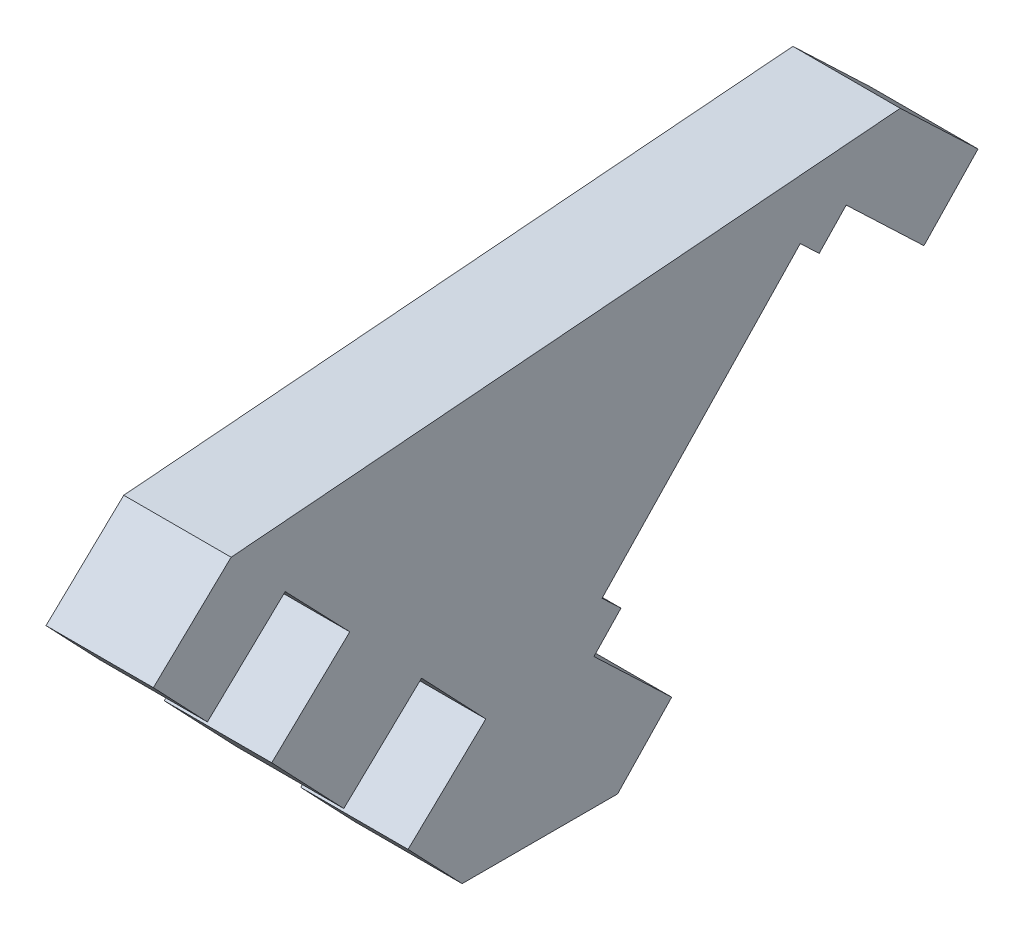
ISO-10303-21;
HEADER;
FILE_DESCRIPTION(('STEP AP214'),'2;1');
FILE_NAME('part.step','',(''),(''),'','','');
FILE_SCHEMA(('AUTOMOTIVE_DESIGN { 1 0 10303 214 1 1 1 1 }'));
ENDSEC;
DATA;
#1=APPLICATION_CONTEXT('core data for automotive mechanical design processes');
#2=APPLICATION_PROTOCOL_DEFINITION('international standard','automotive_design',2000,#1);
#3=PRODUCT_CONTEXT('',#1,'mechanical');
#4=PRODUCT('Part','Part','',(#3));
#5=PRODUCT_RELATED_PRODUCT_CATEGORY('part','',(#4));
#6=PRODUCT_DEFINITION_FORMATION('','',#4);
#7=PRODUCT_DEFINITION_CONTEXT('part definition',#1,'design');
#8=PRODUCT_DEFINITION('design','',#6,#7);
#9=PRODUCT_DEFINITION_SHAPE('','',#8);
#10=(LENGTH_UNIT() NAMED_UNIT(*) SI_UNIT(.MILLI.,.METRE.));
#11=(NAMED_UNIT(*) PLANE_ANGLE_UNIT() SI_UNIT($,.RADIAN.));
#12=(NAMED_UNIT(*) SI_UNIT($,.STERADIAN.) SOLID_ANGLE_UNIT());
#13=UNCERTAINTY_MEASURE_WITH_UNIT(LENGTH_MEASURE(1.E-05),#10,'distance_accuracy_value','');
#14=(GEOMETRIC_REPRESENTATION_CONTEXT(3) GLOBAL_UNCERTAINTY_ASSIGNED_CONTEXT((#13)) GLOBAL_UNIT_ASSIGNED_CONTEXT((#10,
#11,#12)) REPRESENTATION_CONTEXT('',''));
#15=CARTESIAN_POINT('',(0.,0.,0.));
#16=DIRECTION('',(0.,0.,1.));
#17=DIRECTION('',(1.,0.,0.));
#18=AXIS2_PLACEMENT_3D('',#15,#16,#17);
#19=CARTESIAN_POINT('',(108.5,-6.40997256157692,-7.94858198649549));
#20=DIRECTION('',(0.,0.689700373188125,-0.724094879987534));
#21=DIRECTION('',(0.,0.724094879987534,0.689700373188125));
#22=AXIS2_PLACEMENT_3D('',#19,#20,#21);
#23=PLANE('',#22);
#24=DIRECTION('',(0.,0.724094879987534,0.689700373188125));
#25=VECTOR('',#24,1.);
#26=CARTESIAN_POINT('',(112.61,-6.40997256157692,-7.94858198649549));
#27=LINE('',#26,#25);
#28=CARTESIAN_POINT('',(112.61,-6.40997256157692,-7.94858198649549));
#29=VERTEX_POINT('',#28);
#30=CARTESIAN_POINT('',(112.61,-4.23768792161431,-5.8794808669311));
#31=VERTEX_POINT('',#30);
#32=EDGE_CURVE('E204',#29,#31,#27,.T.);
#33=ORIENTED_EDGE('',*,*,#32,.T.);
#34=DIRECTION('',(1.,0.,0.));
#35=VECTOR('',#34,1.);
#36=CARTESIAN_POINT('',(108.5,-4.23768792161431,-5.8794808669311));
#37=LINE('',#36,#35);
#38=CARTESIAN_POINT('',(108.5,-4.23768792161431,-5.8794808669311));
#39=VERTEX_POINT('',#38);
#40=EDGE_CURVE('E11',#39,#31,#37,.T.);
#41=ORIENTED_EDGE('',*,*,#40,.F.);
#42=DIRECTION('',(0.,0.724094879987534,0.689700373188125));
#43=VECTOR('',#42,1.);
#44=CARTESIAN_POINT('',(108.5,-6.40997256157692,-7.94858198649549));
#45=LINE('',#44,#43);
#46=CARTESIAN_POINT('',(108.5,-6.40997256157692,-7.94858198649549));
#47=VERTEX_POINT('',#46);
#48=EDGE_CURVE('E249',#47,#39,#45,.T.);
#49=ORIENTED_EDGE('',*,*,#48,.F.);
#50=DIRECTION('',(1.,0.,0.));
#51=VECTOR('',#50,1.);
#52=CARTESIAN_POINT('',(108.5,-6.40997256157692,-7.94858198649549));
#53=LINE('',#52,#51);
#54=EDGE_CURVE('E56',#47,#29,#53,.T.);
#55=ORIENTED_EDGE('',*,*,#54,.T.);
#56=EDGE_LOOP('',(#33,#41,#49,#55));
#57=FACE_BOUND('',#56,.T.);
#58=ADVANCED_FACE('F33',(#57),#23,.F.);
#59=CARTESIAN_POINT('',(108.5,-4.23768792161431,-5.8794808669311));
#60=DIRECTION('',(0.,-0.724094879987533,-0.689700373188126));
#61=DIRECTION('',(0.,0.689700373188126,-0.724094879987533));
#62=AXIS2_PLACEMENT_3D('',#59,#60,#61);
#63=PLANE('',#62);
#64=DIRECTION('',(0.,0.689700373188126,-0.724094879987533));
#65=VECTOR('',#64,1.);
#66=CARTESIAN_POINT('',(112.61,-4.23768792161431,-5.8794808669311));
#67=LINE('',#66,#65);
#68=CARTESIAN_POINT('',(112.61,-1.40301938781112,-8.85551082367985));
#69=VERTEX_POINT('',#68);
#70=EDGE_CURVE('E206',#31,#69,#67,.T.);
#71=ORIENTED_EDGE('',*,*,#70,.T.);
#72=DIRECTION('',(1.,0.,0.));
#73=VECTOR('',#72,1.);
#74=CARTESIAN_POINT('',(108.5,-1.40301938781112,-8.85551082367985));
#75=LINE('',#74,#73);
#76=CARTESIAN_POINT('',(108.5,-1.40301938781112,-8.85551082367985));
#77=VERTEX_POINT('',#76);
#78=EDGE_CURVE('E40',#77,#69,#75,.T.);
#79=ORIENTED_EDGE('',*,*,#78,.F.);
#80=DIRECTION('',(0.,0.689700373188126,-0.724094879987533));
#81=VECTOR('',#80,1.);
#82=CARTESIAN_POINT('',(108.5,-4.23768792161431,-5.8794808669311));
#83=LINE('',#82,#81);
#84=EDGE_CURVE('E125',#39,#77,#83,.T.);
#85=ORIENTED_EDGE('',*,*,#84,.F.);
#86=ORIENTED_EDGE('',*,*,#40,.T.);
#87=EDGE_LOOP('',(#71,#79,#85,#86));
#88=FACE_BOUND('',#87,.T.);
#89=ADVANCED_FACE('F356',(#88),#63,.F.);
#90=CARTESIAN_POINT('',(108.5,-1.40301938781112,-8.85551082367985));
#91=DIRECTION('',(0.,-0.996735550535678,-0.0807356321480145));
#92=DIRECTION('',(0.,0.0807356321480145,-0.996735550535678));
#93=AXIS2_PLACEMENT_3D('',#90,#91,#92);
#94=PLANE('',#93);
#95=DIRECTION('',(0.,0.0807356321480145,-0.996735550535678));
#96=VECTOR('',#95,1.);
#97=CARTESIAN_POINT('',(112.61,-1.40301938781112,-8.85551082367985));
#98=LINE('',#97,#96);
#99=CARTESIAN_POINT('',(112.61,0.671552745258446,-34.4674957944561));
#100=VERTEX_POINT('',#99);
#101=EDGE_CURVE('E209',#69,#100,#98,.T.);
#102=ORIENTED_EDGE('',*,*,#101,.T.);
#103=DIRECTION('',(1.,0.,0.));
#104=VECTOR('',#103,1.);
#105=CARTESIAN_POINT('',(108.5,0.671552745258446,-34.4674957944561));
#106=LINE('',#105,#104);
#107=CARTESIAN_POINT('',(108.5,0.671552745258446,-34.4674957944561));
#108=VERTEX_POINT('',#107);
#109=EDGE_CURVE('E281',#108,#100,#106,.T.);
#110=ORIENTED_EDGE('',*,*,#109,.F.);
#111=DIRECTION('',(0.,0.0807356321480145,-0.996735550535678));
#112=VECTOR('',#111,1.);
#113=CARTESIAN_POINT('',(108.5,-1.40301938781112,-8.85551082367985));
#114=LINE('',#113,#112);
#115=EDGE_CURVE('E289',#77,#108,#114,.T.);
#116=ORIENTED_EDGE('',*,*,#115,.F.);
#117=ORIENTED_EDGE('',*,*,#78,.T.);
#118=EDGE_LOOP('',(#102,#110,#116,#117));
#119=FACE_BOUND('',#118,.T.);
#120=ADVANCED_FACE('F287',(#119),#94,.F.);
#121=CARTESIAN_POINT('',(108.5,0.671552745258446,-34.4674957944561));
#122=DIRECTION('',(0.,-0.724094879987533,0.689700373188126));
#123=DIRECTION('',(0.,-0.689700373188126,-0.724094879987533));
#124=AXIS2_PLACEMENT_3D('',#121,#122,#123);
#125=PLANE('',#124);
#126=DIRECTION('',(0.,-0.689700373188126,-0.724094879987533));
#127=VECTOR('',#126,1.);
#128=CARTESIAN_POINT('',(112.61,0.671552745258446,-34.4674957944561));
#129=LINE('',#128,#127);
#130=CARTESIAN_POINT('',(112.61,-2.16311578854475,-37.4435257512049));
#131=VERTEX_POINT('',#130);
#132=EDGE_CURVE('E211',#100,#131,#129,.T.);
#133=ORIENTED_EDGE('',*,*,#132,.T.);
#134=DIRECTION('',(1.,0.,0.));
#135=VECTOR('',#134,1.);
#136=CARTESIAN_POINT('',(108.5,-2.16311578854475,-37.4435257512049));
#137=LINE('',#136,#135);
#138=CARTESIAN_POINT('',(108.5,-2.16311578854475,-37.4435257512049));
#139=VERTEX_POINT('',#138);
#140=EDGE_CURVE('E278',#139,#131,#137,.T.);
#141=ORIENTED_EDGE('',*,*,#140,.F.);
#142=DIRECTION('',(0.,-0.689700373188126,-0.724094879987533));
#143=VECTOR('',#142,1.);
#144=CARTESIAN_POINT('',(108.5,0.671552745258446,-34.4674957944561));
#145=LINE('',#144,#143);
#146=EDGE_CURVE('E307',#108,#139,#145,.T.);
#147=ORIENTED_EDGE('',*,*,#146,.F.);
#148=ORIENTED_EDGE('',*,*,#109,.T.);
#149=EDGE_LOOP('',(#133,#141,#147,#148));
#150=FACE_BOUND('',#149,.T.);
#151=ADVANCED_FACE('F297',(#150),#125,.F.);
#152=CARTESIAN_POINT('',(108.5,-2.16311578854475,-37.4435257512049));
#153=DIRECTION('',(0.,0.689700373188127,0.724094879987532));
#154=DIRECTION('',(0.,-0.724094879987532,0.689700373188127));
#155=AXIS2_PLACEMENT_3D('',#152,#153,#154);
#156=PLANE('',#155);
#157=DIRECTION('',(0.,-0.724094879987532,0.689700373188127));
#158=VECTOR('',#157,1.);
#159=CARTESIAN_POINT('',(112.61,-2.16311578854475,-37.4435257512049));
#160=LINE('',#159,#158);
#161=CARTESIAN_POINT('',(112.61,-4.33540042850735,-35.3744246316405));
#162=VERTEX_POINT('',#161);
#163=EDGE_CURVE('E213',#131,#162,#160,.T.);
#164=ORIENTED_EDGE('',*,*,#163,.T.);
#165=DIRECTION('',(1.,0.,0.));
#166=VECTOR('',#165,1.);
#167=CARTESIAN_POINT('',(108.5,-4.33540042850735,-35.3744246316405));
#168=LINE('',#167,#166);
#169=CARTESIAN_POINT('',(108.5,-4.33540042850735,-35.3744246316405));
#170=VERTEX_POINT('',#169);
#171=EDGE_CURVE('E275',#170,#162,#168,.T.);
#172=ORIENTED_EDGE('',*,*,#171,.F.);
#173=DIRECTION('',(0.,-0.724094879987532,0.689700373188127));
#174=VECTOR('',#173,1.);
#175=CARTESIAN_POINT('',(108.5,-2.16311578854475,-37.4435257512049));
#176=LINE('',#175,#174);
#177=EDGE_CURVE('E303',#139,#170,#176,.T.);
#178=ORIENTED_EDGE('',*,*,#177,.F.);
#179=ORIENTED_EDGE('',*,*,#140,.T.);
#180=EDGE_LOOP('',(#164,#172,#178,#179));
#181=FACE_BOUND('',#180,.T.);
#182=ADVANCED_FACE('F301',(#181),#156,.F.);
#183=CARTESIAN_POINT('',(108.5,-4.33540042850735,-35.3744246316405));
#184=DIRECTION('',(0.,0.724094879987532,-0.689700373188127));
#185=DIRECTION('',(0.,0.689700373188127,0.724094879987532));
#186=AXIS2_PLACEMENT_3D('',#183,#184,#185);
#187=PLANE('',#186);
#188=DIRECTION('',(0.,0.689700373188127,0.724094879987532));
#189=VECTOR('',#188,1.);
#190=CARTESIAN_POINT('',(112.61,-4.33540042850735,-35.3744246316405));
#191=LINE('',#190,#189);
#192=CARTESIAN_POINT('',(112.61,-1.50073189470416,-32.3983946748917));
#193=VERTEX_POINT('',#192);
#194=EDGE_CURVE('E215',#162,#193,#191,.T.);
#195=ORIENTED_EDGE('',*,*,#194,.T.);
#196=DIRECTION('',(1.,0.,0.));
#197=VECTOR('',#196,1.);
#198=CARTESIAN_POINT('',(108.5,-1.50073189470416,-32.3983946748917));
#199=LINE('',#198,#197);
#200=CARTESIAN_POINT('',(108.5,-1.50073189470416,-32.3983946748917));
#201=VERTEX_POINT('',#200);
#202=EDGE_CURVE('E272',#201,#193,#199,.T.);
#203=ORIENTED_EDGE('',*,*,#202,.F.);
#204=DIRECTION('',(0.,0.689700373188127,0.724094879987532));
#205=VECTOR('',#204,1.);
#206=CARTESIAN_POINT('',(108.5,-4.33540042850735,-35.3744246316405));
#207=LINE('',#206,#205);
#208=EDGE_CURVE('E306',#170,#201,#207,.T.);
#209=ORIENTED_EDGE('',*,*,#208,.F.);
#210=ORIENTED_EDGE('',*,*,#171,.T.);
#211=EDGE_LOOP('',(#195,#203,#209,#210));
#212=FACE_BOUND('',#211,.T.);
#213=ADVANCED_FACE('F429',(#212),#187,.F.);
#214=CARTESIAN_POINT('',(108.5,-5.15206178771529,-28.9205029517986));
#215=DIRECTION('',(0.,-0.689700373188125,-0.724094879987534));
#216=DIRECTION('',(0.,0.724094879987534,-0.689700373188125));
#217=AXIS2_PLACEMENT_3D('',#214,#215,#216);
#218=PLANE('',#217);
#219=DIRECTION('',(-1.,0.,0.));
#220=VECTOR('',#219,1.);
#221=CARTESIAN_POINT('',(108.499,-2.58687421468546,-31.3638441151095));
#222=LINE('',#221,#220);
#223=CARTESIAN_POINT('',(112.61,-2.58687421468546,-31.3638441151095));
#224=VERTEX_POINT('',#223);
#225=CARTESIAN_POINT('',(108.5,-2.58687421468546,-31.3638441151095));
#226=VERTEX_POINT('',#225);
#227=EDGE_CURVE('E47',#224,#226,#222,.T.);
#228=ORIENTED_EDGE('',*,*,#227,.T.);
#229=DIRECTION('',(0.,0.724094879987534,-0.689700373188125));
#230=VECTOR('',#229,1.);
#231=CARTESIAN_POINT('',(108.5,-5.15206178771529,-28.9205029517986));
#232=LINE('',#231,#230);
#233=EDGE_CURVE('E309',#226,#201,#232,.T.);
#234=ORIENTED_EDGE('',*,*,#233,.T.);
#235=ORIENTED_EDGE('',*,*,#202,.T.);
#236=DIRECTION('',(0.,0.724094879987534,-0.689700373188125));
#237=VECTOR('',#236,1.);
#238=CARTESIAN_POINT('',(112.61,-5.15206178771529,-28.9205029517986));
#239=LINE('',#238,#237);
#240=EDGE_CURVE('E218',#224,#193,#239,.T.);
#241=ORIENTED_EDGE('',*,*,#240,.F.);
#242=EDGE_LOOP('',(#228,#234,#235,#241));
#243=FACE_BOUND('',#242,.T.);
#244=ADVANCED_FACE('F425',(#243),#218,.T.);
#245=CARTESIAN_POINT('',(108.5,-11.6380602145296,-22.742589450258));
#246=DIRECTION('',(0.,-0.689700373188126,-0.724094879987533));
#247=DIRECTION('',(0.,0.724094879987533,-0.689700373188126));
#248=AXIS2_PLACEMENT_3D('',#245,#246,#247);
#249=PLANE('',#248);
#250=DIRECTION('',(1.,0.,0.));
#251=VECTOR('',#250,1.);
#252=CARTESIAN_POINT('',(108.499,-10.5519178945483,-23.7771400100402));
#253=LINE('',#252,#251);
#254=CARTESIAN_POINT('',(108.5,-10.5519178945483,-23.7771400100402));
#255=VERTEX_POINT('',#254);
#256=CARTESIAN_POINT('',(112.61,-10.5519178945483,-23.7771400100402));
#257=VERTEX_POINT('',#256);
#258=EDGE_CURVE('E387',#255,#257,#253,.T.);
#259=ORIENTED_EDGE('',*,*,#258,.T.);
#260=DIRECTION('',(0.,0.724094879987533,-0.689700373188126));
#261=VECTOR('',#260,1.);
#262=CARTESIAN_POINT('',(112.61,-11.6380602145296,-22.742589450258));
#263=LINE('',#262,#261);
#264=CARTESIAN_POINT('',(112.61,-11.6380602145296,-22.742589450258));
#265=VERTEX_POINT('',#264);
#266=EDGE_CURVE('E220',#265,#257,#263,.T.);
#267=ORIENTED_EDGE('',*,*,#266,.F.);
#268=DIRECTION('',(1.,0.,0.));
#269=VECTOR('',#268,1.);
#270=CARTESIAN_POINT('',(108.5,-11.6380602145296,-22.742589450258));
#271=LINE('',#270,#269);
#272=CARTESIAN_POINT('',(108.5,-11.6380602145296,-22.742589450258));
#273=VERTEX_POINT('',#272);
#274=EDGE_CURVE('E270',#273,#265,#271,.T.);
#275=ORIENTED_EDGE('',*,*,#274,.F.);
#276=DIRECTION('',(0.,0.724094879987533,-0.689700373188126));
#277=VECTOR('',#276,1.);
#278=CARTESIAN_POINT('',(108.5,-11.6380602145296,-22.742589450258));
#279=LINE('',#278,#277);
#280=EDGE_CURVE('E315',#273,#255,#279,.T.);
#281=ORIENTED_EDGE('',*,*,#280,.T.);
#282=EDGE_LOOP('',(#259,#267,#275,#281));
#283=FACE_BOUND('',#282,.T.);
#284=ADVANCED_FACE('F393',(#283),#249,.T.);
#285=CARTESIAN_POINT('',(108.5,-14.4727287483328,-25.7186194070067));
#286=DIRECTION('',(0.,0.724094879987533,-0.689700373188126));
#287=DIRECTION('',(0.,0.689700373188126,0.724094879987533));
#288=AXIS2_PLACEMENT_3D('',#285,#286,#287);
#289=PLANE('',#288);
#290=DIRECTION('',(0.,0.689700373188126,0.724094879987533));
#291=VECTOR('',#290,1.);
#292=CARTESIAN_POINT('',(112.61,-14.4727287483328,-25.7186194070067));
#293=LINE('',#292,#291);
#294=CARTESIAN_POINT('',(112.61,-14.4727287483328,-25.7186194070067));
#295=VERTEX_POINT('',#294);
#296=EDGE_CURVE('E223',#295,#265,#293,.T.);
#297=ORIENTED_EDGE('',*,*,#296,.F.);
#298=DIRECTION('',(1.,0.,0.));
#299=VECTOR('',#298,1.);
#300=CARTESIAN_POINT('',(108.5,-14.4727287483328,-25.7186194070067));
#301=LINE('',#300,#299);
#302=CARTESIAN_POINT('',(108.5,-14.4727287483328,-25.7186194070067));
#303=VERTEX_POINT('',#302);
#304=EDGE_CURVE('E268',#303,#295,#301,.T.);
#305=ORIENTED_EDGE('',*,*,#304,.F.);
#306=DIRECTION('',(0.,0.689700373188126,0.724094879987533));
#307=VECTOR('',#306,1.);
#308=CARTESIAN_POINT('',(108.5,-14.4727287483328,-25.7186194070067));
#309=LINE('',#308,#307);
#310=EDGE_CURVE('E318',#303,#273,#309,.T.);
#311=ORIENTED_EDGE('',*,*,#310,.T.);
#312=ORIENTED_EDGE('',*,*,#274,.T.);
#313=EDGE_LOOP('',(#297,#305,#311,#312));
#314=FACE_BOUND('',#313,.T.);
#315=ADVANCED_FACE('F406',(#314),#289,.T.);
#316=CARTESIAN_POINT('',(108.5,-14.4727287483328,-25.7186194070067));
#317=DIRECTION('',(0.,0.689700373188118,0.724094879987541));
#318=DIRECTION('',(0.,-0.724094879987541,0.689700373188118));
#319=AXIS2_PLACEMENT_3D('',#316,#317,#318);
#320=PLANE('',#319);
#321=DIRECTION('',(0.,-0.724094879987541,0.689700373188118));
#322=VECTOR('',#321,1.);
#323=CARTESIAN_POINT('',(112.61,-14.4727287483328,-25.7186194070067));
#324=LINE('',#323,#322);
#325=CARTESIAN_POINT('',(112.61,-16.6450133882954,-23.6495182874424));
#326=VERTEX_POINT('',#325);
#327=EDGE_CURVE('E226',#295,#326,#324,.T.);
#328=ORIENTED_EDGE('',*,*,#327,.T.);
#329=DIRECTION('',(1.,0.,0.));
#330=VECTOR('',#329,1.);
#331=CARTESIAN_POINT('',(108.5,-16.6450133882954,-23.6495182874424));
#332=LINE('',#331,#330);
#333=CARTESIAN_POINT('',(108.5,-16.6450133882954,-23.6495182874424));
#334=VERTEX_POINT('',#333);
#335=EDGE_CURVE('E265',#334,#326,#332,.T.);
#336=ORIENTED_EDGE('',*,*,#335,.F.);
#337=DIRECTION('',(0.,-0.724094879987541,0.689700373188118));
#338=VECTOR('',#337,1.);
#339=CARTESIAN_POINT('',(108.5,-14.4727287483328,-25.7186194070067));
#340=LINE('',#339,#338);
#341=EDGE_CURVE('E321',#303,#334,#340,.T.);
#342=ORIENTED_EDGE('',*,*,#341,.F.);
#343=ORIENTED_EDGE('',*,*,#304,.T.);
#344=EDGE_LOOP('',(#328,#336,#342,#343));
#345=FACE_BOUND('',#344,.T.);
#346=ADVANCED_FACE('F469',(#345),#320,.F.);
#347=CARTESIAN_POINT('',(108.5,-16.6450133882954,-23.6495182874424));
#348=DIRECTION('',(0.,1.,0.));
#349=DIRECTION('',(0.,0.,1.));
#350=AXIS2_PLACEMENT_3D('',#347,#348,#349);
#351=PLANE('',#350);
#352=DIRECTION('',(0.,0.,1.));
#353=VECTOR('',#352,1.);
#354=CARTESIAN_POINT('',(112.61,-16.6450133882954,-23.6495182874424));
#355=LINE('',#354,#353);
#356=CARTESIAN_POINT('',(112.61,-16.6450133882954,-17.6974583739448));
#357=VERTEX_POINT('',#356);
#358=EDGE_CURVE('E228',#326,#357,#355,.T.);
#359=ORIENTED_EDGE('',*,*,#358,.T.);
#360=DIRECTION('',(1.,0.,0.));
#361=VECTOR('',#360,1.);
#362=CARTESIAN_POINT('',(108.5,-16.6450133882954,-17.6974583739448));
#363=LINE('',#362,#361);
#364=CARTESIAN_POINT('',(108.5,-16.6450133882954,-17.6974583739448));
#365=VERTEX_POINT('',#364);
#366=EDGE_CURVE('E262',#365,#357,#363,.T.);
#367=ORIENTED_EDGE('',*,*,#366,.F.);
#368=DIRECTION('',(0.,0.,1.));
#369=VECTOR('',#368,1.);
#370=CARTESIAN_POINT('',(108.5,-16.6450133882954,-23.6495182874424));
#371=LINE('',#370,#369);
#372=EDGE_CURVE('E323',#334,#365,#371,.T.);
#373=ORIENTED_EDGE('',*,*,#372,.F.);
#374=ORIENTED_EDGE('',*,*,#335,.T.);
#375=EDGE_LOOP('',(#359,#367,#373,#374));
#376=FACE_BOUND('',#375,.T.);
#377=ADVANCED_FACE('F480',(#376),#351,.F.);
#378=CARTESIAN_POINT('',(108.5,-16.6450133882954,-17.6974583739448));
#379=DIRECTION('',(0.,0.689700373188125,-0.724094879987534));
#380=DIRECTION('',(0.,0.724094879987534,0.689700373188125));
#381=AXIS2_PLACEMENT_3D('',#378,#379,#380);
#382=PLANE('',#381);
#383=DIRECTION('',(0.,0.724094879987534,0.689700373188125));
#384=VECTOR('',#383,1.);
#385=CARTESIAN_POINT('',(112.61,-16.6450133882954,-17.6974583739448));
#386=LINE('',#385,#384);
#387=CARTESIAN_POINT('',(112.61,-14.4727287483328,-15.6283572543805));
#388=VERTEX_POINT('',#387);
#389=EDGE_CURVE('E230',#357,#388,#386,.T.);
#390=ORIENTED_EDGE('',*,*,#389,.T.);
#391=DIRECTION('',(1.,0.,0.));
#392=VECTOR('',#391,1.);
#393=CARTESIAN_POINT('',(108.5,-14.4727287483328,-15.6283572543805));
#394=LINE('',#393,#392);
#395=CARTESIAN_POINT('',(108.5,-14.4727287483328,-15.6283572543805));
#396=VERTEX_POINT('',#395);
#397=EDGE_CURVE('E259',#396,#388,#394,.T.);
#398=ORIENTED_EDGE('',*,*,#397,.F.);
#399=DIRECTION('',(0.,0.724094879987534,0.689700373188125));
#400=VECTOR('',#399,1.);
#401=CARTESIAN_POINT('',(108.5,-16.6450133882954,-17.6974583739448));
#402=LINE('',#401,#400);
#403=EDGE_CURVE('E325',#365,#396,#402,.T.);
#404=ORIENTED_EDGE('',*,*,#403,.F.);
#405=ORIENTED_EDGE('',*,*,#366,.T.);
#406=EDGE_LOOP('',(#390,#398,#404,#405));
#407=FACE_BOUND('',#406,.T.);
#408=ADVANCED_FACE('F490',(#407),#382,.F.);
#409=CARTESIAN_POINT('',(108.5,-14.4727287483328,-15.6283572543805));
#410=DIRECTION('',(0.,-0.724094879987534,-0.689700373188125));
#411=DIRECTION('',(0.,0.689700373188125,-0.724094879987534));
#412=AXIS2_PLACEMENT_3D('',#409,#410,#411);
#413=PLANE('',#412);
#414=DIRECTION('',(0.,0.689700373188125,-0.724094879987534));
#415=VECTOR('',#414,1.);
#416=CARTESIAN_POINT('',(112.61,-14.4727287483328,-15.6283572543805));
#417=LINE('',#416,#415);
#418=CARTESIAN_POINT('',(112.61,-11.6380602145296,-18.6043872111292));
#419=VERTEX_POINT('',#418);
#420=EDGE_CURVE('E232',#388,#419,#417,.T.);
#421=ORIENTED_EDGE('',*,*,#420,.T.);
#422=DIRECTION('',(1.,0.,0.));
#423=VECTOR('',#422,1.);
#424=CARTESIAN_POINT('',(108.5,-11.6380602145296,-18.6043872111292));
#425=LINE('',#424,#423);
#426=CARTESIAN_POINT('',(108.5,-11.6380602145296,-18.6043872111292));
#427=VERTEX_POINT('',#426);
#428=EDGE_CURVE('E257',#427,#419,#425,.T.);
#429=ORIENTED_EDGE('',*,*,#428,.F.);
#430=DIRECTION('',(0.,0.689700373188125,-0.724094879987534));
#431=VECTOR('',#430,1.);
#432=CARTESIAN_POINT('',(108.5,-14.4727287483328,-15.6283572543805));
#433=LINE('',#432,#431);
#434=EDGE_CURVE('E327',#396,#427,#433,.T.);
#435=ORIENTED_EDGE('',*,*,#434,.F.);
#436=ORIENTED_EDGE('',*,*,#397,.T.);
#437=EDGE_LOOP('',(#421,#429,#435,#436));
#438=FACE_BOUND('',#437,.T.);
#439=ADVANCED_FACE('F500',(#438),#413,.F.);
#440=CARTESIAN_POINT('',(108.5,-9.05487188112677,-16.143900323563));
#441=DIRECTION('',(0.,-0.689700373188125,0.724094879987534));
#442=DIRECTION('',(0.,-0.724094879987534,-0.689700373188125));
#443=AXIS2_PLACEMENT_3D('',#440,#441,#442);
#444=PLANE('',#443);
#445=DIRECTION('',(0.,-0.724094879987534,-0.689700373188125));
#446=VECTOR('',#445,1.);
#447=CARTESIAN_POINT('',(112.61,-9.05487188112677,-16.143900323563));
#448=LINE('',#447,#446);
#449=CARTESIAN_POINT('',(112.61,-9.05487188112677,-16.143900323563));
#450=VERTEX_POINT('',#449);
#451=EDGE_CURVE('E235',#450,#419,#448,.T.);
#452=ORIENTED_EDGE('',*,*,#451,.F.);
#453=DIRECTION('',(1.,0.,0.));
#454=VECTOR('',#453,1.);
#455=CARTESIAN_POINT('',(108.5,-9.05487188112677,-16.143900323563));
#456=LINE('',#455,#454);
#457=CARTESIAN_POINT('',(108.5,-9.05487188112677,-16.143900323563));
#458=VERTEX_POINT('',#457);
#459=EDGE_CURVE('E255',#458,#450,#456,.T.);
#460=ORIENTED_EDGE('',*,*,#459,.F.);
#461=DIRECTION('',(0.,-0.724094879987534,-0.689700373188125));
#462=VECTOR('',#461,1.);
#463=CARTESIAN_POINT('',(108.5,-9.05487188112677,-16.143900323563));
#464=LINE('',#463,#462);
#465=EDGE_CURVE('E329',#458,#427,#464,.T.);
#466=ORIENTED_EDGE('',*,*,#465,.T.);
#467=ORIENTED_EDGE('',*,*,#428,.T.);
#468=EDGE_LOOP('',(#452,#460,#466,#467));
#469=FACE_BOUND('',#468,.T.);
#470=ADVANCED_FACE('F342',(#469),#444,.T.);
#471=CARTESIAN_POINT('',(108.5,-11.88954041493,-13.1678703668143));
#472=DIRECTION('',(0.,-0.724094879987534,-0.689700373188125));
#473=DIRECTION('',(0.,0.689700373188125,-0.724094879987534));
#474=AXIS2_PLACEMENT_3D('',#471,#472,#473);
#475=PLANE('',#474);
#476=DIRECTION('',(0.,0.689700373188125,-0.724094879987534));
#477=VECTOR('',#476,1.);
#478=CARTESIAN_POINT('',(112.61,-11.88954041493,-13.1678703668143));
#479=LINE('',#478,#477);
#480=CARTESIAN_POINT('',(112.61,-11.88954041493,-13.1678703668143));
#481=VERTEX_POINT('',#480);
#482=EDGE_CURVE('E238',#481,#450,#479,.T.);
#483=ORIENTED_EDGE('',*,*,#482,.F.);
#484=DIRECTION('',(1.,0.,0.));
#485=VECTOR('',#484,1.);
#486=CARTESIAN_POINT('',(108.5,-11.88954041493,-13.1678703668143));
#487=LINE('',#486,#485);
#488=CARTESIAN_POINT('',(108.5,-11.88954041493,-13.1678703668143));
#489=VERTEX_POINT('',#488);
#490=EDGE_CURVE('E253',#489,#481,#487,.T.);
#491=ORIENTED_EDGE('',*,*,#490,.F.);
#492=DIRECTION('',(0.,0.689700373188125,-0.724094879987534));
#493=VECTOR('',#492,1.);
#494=CARTESIAN_POINT('',(108.5,-11.88954041493,-13.1678703668143));
#495=LINE('',#494,#493);
#496=EDGE_CURVE('E332',#489,#458,#495,.T.);
#497=ORIENTED_EDGE('',*,*,#496,.T.);
#498=ORIENTED_EDGE('',*,*,#459,.T.);
#499=EDGE_LOOP('',(#483,#491,#497,#498));
#500=FACE_BOUND('',#499,.T.);
#501=ADVANCED_FACE('F336',(#500),#475,.T.);
#502=CARTESIAN_POINT('',(108.5,-11.88954041493,-13.1678703668143));
#503=DIRECTION('',(0.,0.689700373188125,-0.724094879987534));
#504=DIRECTION('',(0.,0.724094879987534,0.689700373188125));
#505=AXIS2_PLACEMENT_3D('',#502,#503,#504);
#506=PLANE('',#505);
#507=DIRECTION('',(0.,0.724094879987534,0.689700373188125));
#508=VECTOR('',#507,1.);
#509=CARTESIAN_POINT('',(112.61,-11.88954041493,-13.1678703668143));
#510=LINE('',#509,#508);
#511=CARTESIAN_POINT('',(112.61,-8.99316089497979,-10.4090688740617));
#512=VERTEX_POINT('',#511);
#513=EDGE_CURVE('E241',#481,#512,#510,.T.);
#514=ORIENTED_EDGE('',*,*,#513,.T.);
#515=DIRECTION('',(1.,0.,0.));
#516=VECTOR('',#515,1.);
#517=CARTESIAN_POINT('',(108.5,-8.99316089497979,-10.4090688740617));
#518=LINE('',#517,#516);
#519=CARTESIAN_POINT('',(108.5,-8.99316089497979,-10.4090688740617));
#520=VERTEX_POINT('',#519);
#521=EDGE_CURVE('E195',#520,#512,#518,.T.);
#522=ORIENTED_EDGE('',*,*,#521,.F.);
#523=DIRECTION('',(0.,0.724094879987534,0.689700373188125));
#524=VECTOR('',#523,1.);
#525=CARTESIAN_POINT('',(108.5,-11.88954041493,-13.1678703668143));
#526=LINE('',#525,#524);
#527=EDGE_CURVE('E182',#489,#520,#526,.T.);
#528=ORIENTED_EDGE('',*,*,#527,.F.);
#529=ORIENTED_EDGE('',*,*,#490,.T.);
#530=EDGE_LOOP('',(#514,#522,#528,#529));
#531=FACE_BOUND('',#530,.T.);
#532=ADVANCED_FACE('F346',(#531),#506,.F.);
#533=CARTESIAN_POINT('',(108.5,-8.99316089497979,-10.4090688740617));
#534=DIRECTION('',(0.,-0.724094879987533,-0.689700373188126));
#535=DIRECTION('',(0.,0.689700373188126,-0.724094879987533));
#536=AXIS2_PLACEMENT_3D('',#533,#534,#535);
#537=PLANE('',#536);
#538=DIRECTION('',(0.,0.689700373188126,-0.724094879987533));
#539=VECTOR('',#538,1.);
#540=CARTESIAN_POINT('',(112.61,-8.99316089497979,-10.4090688740617));
#541=LINE('',#540,#539);
#542=CARTESIAN_POINT('',(112.61,-6.1468231766742,-13.397349943149));
#543=VERTEX_POINT('',#542);
#544=EDGE_CURVE('E191',#512,#543,#541,.T.);
#545=ORIENTED_EDGE('',*,*,#544,.T.);
#546=DIRECTION('',(1.,0.,0.));
#547=VECTOR('',#546,1.);
#548=CARTESIAN_POINT('',(108.5,-6.1468231766742,-13.397349943149));
#549=LINE('',#548,#547);
#550=CARTESIAN_POINT('',(108.5,-6.1468231766742,-13.397349943149));
#551=VERTEX_POINT('',#550);
#552=EDGE_CURVE('E188',#551,#543,#549,.T.);
#553=ORIENTED_EDGE('',*,*,#552,.F.);
#554=DIRECTION('',(0.,0.689700373188126,-0.724094879987533));
#555=VECTOR('',#554,1.);
#556=CARTESIAN_POINT('',(108.5,-8.99316089497979,-10.4090688740617));
#557=LINE('',#556,#555);
#558=EDGE_CURVE('E173',#520,#551,#557,.T.);
#559=ORIENTED_EDGE('',*,*,#558,.F.);
#560=ORIENTED_EDGE('',*,*,#521,.T.);
#561=EDGE_LOOP('',(#545,#553,#559,#560));
#562=FACE_BOUND('',#561,.T.);
#563=ADVANCED_FACE('F189',(#562),#537,.F.);
#564=CARTESIAN_POINT('',(108.5,-3.57530402777374,-10.9246119432442));
#565=DIRECTION('',(0.,-0.693126693876089,0.720815778293179));
#566=DIRECTION('',(0.,-0.720815778293179,-0.693126693876089));
#567=AXIS2_PLACEMENT_3D('',#564,#565,#566);
#568=PLANE('',#567);
#569=DIRECTION('',(0.,-0.720815778293179,-0.693126693876089));
#570=VECTOR('',#569,1.);
#571=CARTESIAN_POINT('',(112.61,-3.57530402777374,-10.9246119432442));
#572=LINE('',#571,#570);
#573=CARTESIAN_POINT('',(112.61,-3.57530402777374,-10.9246119432442));
#574=VERTEX_POINT('',#573);
#575=EDGE_CURVE('E244',#574,#543,#572,.T.);
#576=ORIENTED_EDGE('',*,*,#575,.F.);
#577=DIRECTION('',(1.,0.,0.));
#578=VECTOR('',#577,1.);
#579=CARTESIAN_POINT('',(108.5,-3.57530402777374,-10.9246119432442));
#580=LINE('',#579,#578);
#581=CARTESIAN_POINT('',(108.5,-3.57530402777374,-10.9246119432442));
#582=VERTEX_POINT('',#581);
#583=EDGE_CURVE('E196',#582,#574,#580,.T.);
#584=ORIENTED_EDGE('',*,*,#583,.F.);
#585=DIRECTION('',(0.,-0.720815778293179,-0.693126693876089));
#586=VECTOR('',#585,1.);
#587=CARTESIAN_POINT('',(108.5,-3.57530402777374,-10.9246119432442));
#588=LINE('',#587,#586);
#589=EDGE_CURVE('E179',#582,#551,#588,.T.);
#590=ORIENTED_EDGE('',*,*,#589,.T.);
#591=ORIENTED_EDGE('',*,*,#552,.T.);
#592=EDGE_LOOP('',(#576,#584,#590,#591));
#593=FACE_BOUND('',#592,.T.);
#594=ADVANCED_FACE('F198',(#593),#568,.T.);
#595=CARTESIAN_POINT('',(108.5,-6.40997256157692,-7.94858198649549));
#596=DIRECTION('',(0.,-0.724094879987534,-0.689700373188125));
#597=DIRECTION('',(0.,0.689700373188125,-0.724094879987534));
#598=AXIS2_PLACEMENT_3D('',#595,#596,#597);
#599=PLANE('',#598);
#600=DIRECTION('',(0.,0.689700373188125,-0.724094879987534));
#601=VECTOR('',#600,1.);
#602=CARTESIAN_POINT('',(112.61,-6.40997256157692,-7.94858198649549));
#603=LINE('',#602,#601);
#604=EDGE_CURVE('E246',#29,#574,#603,.T.);
#605=ORIENTED_EDGE('',*,*,#604,.F.);
#606=ORIENTED_EDGE('',*,*,#54,.F.);
#607=DIRECTION('',(0.,0.689700373188125,-0.724094879987534));
#608=VECTOR('',#607,1.);
#609=CARTESIAN_POINT('',(108.5,-6.40997256157692,-7.94858198649549));
#610=LINE('',#609,#608);
#611=EDGE_CURVE('E199',#47,#582,#610,.T.);
#612=ORIENTED_EDGE('',*,*,#611,.T.);
#613=ORIENTED_EDGE('',*,*,#583,.T.);
#614=EDGE_LOOP('',(#605,#606,#612,#613));
#615=FACE_BOUND('',#614,.T.);
#616=ADVANCED_FACE('F361',(#615),#599,.T.);
#617=CARTESIAN_POINT('',(108.5,0.,0.));
#618=DIRECTION('',(-1.,0.,0.));
#619=DIRECTION('',(0.,0.,1.));
#620=AXIS2_PLACEMENT_3D('',#617,#618,#619);
#621=PLANE('',#620);
#622=DIRECTION('',(0.,-0.689700373188126,-0.724094879987533));
#623=VECTOR('',#622,1.);
#624=CARTESIAN_POINT('',(108.5,-10.5519178945483,-23.7771400100402));
#625=LINE('',#624,#623);
#626=CARTESIAN_POINT('',(108.5,-9.86221752136021,-23.0530451300526));
#627=VERTEX_POINT('',#626);
#628=EDGE_CURVE('E381',#627,#255,#625,.T.);
#629=ORIENTED_EDGE('',*,*,#628,.T.);
#630=ORIENTED_EDGE('',*,*,#280,.F.);
#631=ORIENTED_EDGE('',*,*,#310,.F.);
#632=ORIENTED_EDGE('',*,*,#341,.T.);
#633=ORIENTED_EDGE('',*,*,#372,.T.);
#634=ORIENTED_EDGE('',*,*,#403,.T.);
#635=ORIENTED_EDGE('',*,*,#434,.T.);
#636=ORIENTED_EDGE('',*,*,#465,.F.);
#637=ORIENTED_EDGE('',*,*,#496,.F.);
#638=ORIENTED_EDGE('',*,*,#527,.T.);
#639=ORIENTED_EDGE('',*,*,#558,.T.);
#640=ORIENTED_EDGE('',*,*,#589,.F.);
#641=ORIENTED_EDGE('',*,*,#611,.F.);
#642=ORIENTED_EDGE('',*,*,#48,.T.);
#643=ORIENTED_EDGE('',*,*,#84,.T.);
#644=ORIENTED_EDGE('',*,*,#115,.T.);
#645=ORIENTED_EDGE('',*,*,#146,.T.);
#646=ORIENTED_EDGE('',*,*,#177,.T.);
#647=ORIENTED_EDGE('',*,*,#208,.T.);
#648=ORIENTED_EDGE('',*,*,#233,.F.);
#649=DIRECTION('',(0.,0.689700373188126,0.724094879987533));
#650=VECTOR('',#649,1.);
#651=CARTESIAN_POINT('',(108.5,-1.89717384149733,-30.639749235122));
#652=LINE('',#651,#650);
#653=CARTESIAN_POINT('',(108.5,-1.89717384149733,-30.639749235122));
#654=VERTEX_POINT('',#653);
#655=EDGE_CURVE('E207',#226,#654,#652,.T.);
#656=ORIENTED_EDGE('',*,*,#655,.T.);
#657=DIRECTION('',(0.,-0.724094879987534,0.689700373188125));
#658=VECTOR('',#657,1.);
#659=CARTESIAN_POINT('',(108.5,-9.86221752136021,-23.0530451300526));
#660=LINE('',#659,#658);
#661=EDGE_CURVE('E383',#654,#627,#660,.T.);
#662=ORIENTED_EDGE('',*,*,#661,.T.);
#663=EDGE_LOOP('',(#629,#630,#631,#632,#633,#634,#635,#636,#637,#638,#639,#640,#641,#642,#643,
#644,#645,#646,#647,#648,#656,#662));
#664=FACE_BOUND('',#663,.T.);
#665=ADVANCED_FACE('F176',(#664),#621,.T.);
#666=CARTESIAN_POINT('',(112.61,0.,0.));
#667=DIRECTION('',(-1.,0.,0.));
#668=DIRECTION('',(0.,0.,1.));
#669=AXIS2_PLACEMENT_3D('',#666,#667,#668);
#670=PLANE('',#669);
#671=ORIENTED_EDGE('',*,*,#266,.T.);
#672=DIRECTION('',(0.,-0.689700373188126,-0.724094879987533));
#673=VECTOR('',#672,1.);
#674=CARTESIAN_POINT('',(112.61,-10.5519178945483,-23.7771400100402));
#675=LINE('',#674,#673);
#676=CARTESIAN_POINT('',(112.61,-9.86221752136021,-23.0530451300526));
#677=VERTEX_POINT('',#676);
#678=EDGE_CURVE('E371',#677,#257,#675,.T.);
#679=ORIENTED_EDGE('',*,*,#678,.F.);
#680=DIRECTION('',(0.,-0.724094879987534,0.689700373188125));
#681=VECTOR('',#680,1.);
#682=CARTESIAN_POINT('',(112.61,-9.86221752136021,-23.0530451300526));
#683=LINE('',#682,#681);
#684=CARTESIAN_POINT('',(112.61,-1.89717384149733,-30.639749235122));
#685=VERTEX_POINT('',#684);
#686=EDGE_CURVE('E376',#685,#677,#683,.T.);
#687=ORIENTED_EDGE('',*,*,#686,.F.);
#688=DIRECTION('',(0.,0.689700373188126,0.724094879987533));
#689=VECTOR('',#688,1.);
#690=CARTESIAN_POINT('',(112.61,-1.89717384149733,-30.639749235122));
#691=LINE('',#690,#689);
#692=EDGE_CURVE('E379',#224,#685,#691,.T.);
#693=ORIENTED_EDGE('',*,*,#692,.F.);
#694=ORIENTED_EDGE('',*,*,#240,.T.);
#695=ORIENTED_EDGE('',*,*,#194,.F.);
#696=ORIENTED_EDGE('',*,*,#163,.F.);
#697=ORIENTED_EDGE('',*,*,#132,.F.);
#698=ORIENTED_EDGE('',*,*,#101,.F.);
#699=ORIENTED_EDGE('',*,*,#70,.F.);
#700=ORIENTED_EDGE('',*,*,#32,.F.);
#701=ORIENTED_EDGE('',*,*,#604,.T.);
#702=ORIENTED_EDGE('',*,*,#575,.T.);
#703=ORIENTED_EDGE('',*,*,#544,.F.);
#704=ORIENTED_EDGE('',*,*,#513,.F.);
#705=ORIENTED_EDGE('',*,*,#482,.T.);
#706=ORIENTED_EDGE('',*,*,#451,.T.);
#707=ORIENTED_EDGE('',*,*,#420,.F.);
#708=ORIENTED_EDGE('',*,*,#389,.F.);
#709=ORIENTED_EDGE('',*,*,#358,.F.);
#710=ORIENTED_EDGE('',*,*,#327,.F.);
#711=ORIENTED_EDGE('',*,*,#296,.T.);
#712=EDGE_LOOP('',(#671,#679,#687,#693,#694,#695,#696,#697,#698,#699,#700,#701,#702,#703,#704,
#705,#706,#707,#708,#709,#710,#711));
#713=FACE_BOUND('',#712,.T.);
#714=ADVANCED_FACE('F292',(#713),#670,.F.);
#715=CARTESIAN_POINT('',(108.499,-10.5519178945483,-23.7771400100402));
#716=DIRECTION('',(0.,-0.724094879987532,0.689700373188126));
#717=DIRECTION('',(0.,-0.689700373188126,-0.724094879987533));
#718=AXIS2_PLACEMENT_3D('',#715,#716,#717);
#719=PLANE('',#718);
#720=ORIENTED_EDGE('',*,*,#628,.F.);
#721=DIRECTION('',(1.,0.,0.));
#722=VECTOR('',#721,1.);
#723=CARTESIAN_POINT('',(108.499,-9.86221752136021,-23.0530451300526));
#724=LINE('',#723,#722);
#725=EDGE_CURVE('E367',#627,#677,#724,.T.);
#726=ORIENTED_EDGE('',*,*,#725,.T.);
#727=ORIENTED_EDGE('',*,*,#678,.T.);
#728=ORIENTED_EDGE('',*,*,#258,.F.);
#729=EDGE_LOOP('',(#720,#726,#727,#728));
#730=FACE_BOUND('',#729,.T.);
#731=ADVANCED_FACE('F411',(#730),#719,.F.);
#732=CARTESIAN_POINT('',(108.499,-9.86221752136021,-23.0530451300526));
#733=DIRECTION('',(0.,0.689700373188125,0.724094879987534));
#734=DIRECTION('',(0.,-0.724094879987534,0.689700373188125));
#735=AXIS2_PLACEMENT_3D('',#732,#733,#734);
#736=PLANE('',#735);
#737=DIRECTION('',(1.,0.,0.));
#738=VECTOR('',#737,1.);
#739=CARTESIAN_POINT('',(108.499,-1.89717384149733,-30.639749235122));
#740=LINE('',#739,#738);
#741=EDGE_CURVE('E368',#654,#685,#740,.T.);
#742=ORIENTED_EDGE('',*,*,#741,.T.);
#743=ORIENTED_EDGE('',*,*,#686,.T.);
#744=ORIENTED_EDGE('',*,*,#725,.F.);
#745=ORIENTED_EDGE('',*,*,#661,.F.);
#746=EDGE_LOOP('',(#742,#743,#744,#745));
#747=FACE_BOUND('',#746,.T.);
#748=ADVANCED_FACE('F421',(#747),#736,.F.);
#749=CARTESIAN_POINT('',(108.499,-1.89717384149733,-30.639749235122));
#750=DIRECTION('',(0.,0.724094879987533,-0.689700373188126));
#751=DIRECTION('',(0.,0.689700373188126,0.724094879987533));
#752=AXIS2_PLACEMENT_3D('',#749,#750,#751);
#753=PLANE('',#752);
#754=ORIENTED_EDGE('',*,*,#692,.T.);
#755=ORIENTED_EDGE('',*,*,#741,.F.);
#756=ORIENTED_EDGE('',*,*,#655,.F.);
#757=ORIENTED_EDGE('',*,*,#227,.F.);
#758=EDGE_LOOP('',(#754,#755,#756,#757));
#759=FACE_BOUND('',#758,.T.);
#760=ADVANCED_FACE('F422',(#759),#753,.F.);
#761=CLOSED_SHELL('',(#58,#89,#120,#151,#182,#213,#244,#284,#315,#346,#377,#408,#439,#470,#501,
#532,#563,#594,#616,#665,#714,#731,#748,#760));
#762=MANIFOLD_SOLID_BREP('B2',#761);
#763=ADVANCED_BREP_SHAPE_REPRESENTATION('',(#18,#762),#14);
#764=SHAPE_DEFINITION_REPRESENTATION(#9,#763);
ENDSEC;
END-ISO-10303-21;
